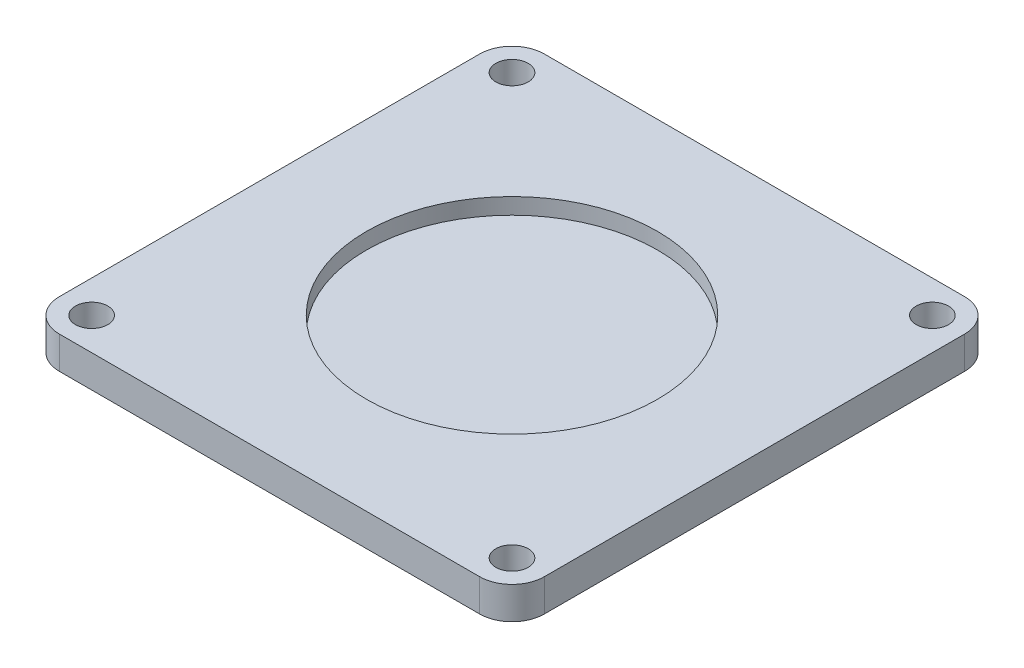
ISO-10303-21;
HEADER;
FILE_DESCRIPTION(('STEP AP214'),'2;1');
FILE_NAME('part.step','',(''),(''),'','','');
FILE_SCHEMA(('AUTOMOTIVE_DESIGN { 1 0 10303 214 1 1 1 1 }'));
ENDSEC;
DATA;
#1=APPLICATION_CONTEXT('core data for automotive mechanical design processes');
#2=APPLICATION_PROTOCOL_DEFINITION('international standard','automotive_design',2000,#1);
#3=PRODUCT_CONTEXT('',#1,'mechanical');
#4=PRODUCT('Part','Part','',(#3));
#5=PRODUCT_RELATED_PRODUCT_CATEGORY('part','',(#4));
#6=PRODUCT_DEFINITION_FORMATION('','',#4);
#7=PRODUCT_DEFINITION_CONTEXT('part definition',#1,'design');
#8=PRODUCT_DEFINITION('design','',#6,#7);
#9=PRODUCT_DEFINITION_SHAPE('','',#8);
#10=(LENGTH_UNIT() NAMED_UNIT(*) SI_UNIT(.MILLI.,.METRE.));
#11=(NAMED_UNIT(*) PLANE_ANGLE_UNIT() SI_UNIT($,.RADIAN.));
#12=(NAMED_UNIT(*) SI_UNIT($,.STERADIAN.) SOLID_ANGLE_UNIT());
#13=UNCERTAINTY_MEASURE_WITH_UNIT(LENGTH_MEASURE(1.E-05),#10,'distance_accuracy_value','');
#14=(GEOMETRIC_REPRESENTATION_CONTEXT(3) GLOBAL_UNCERTAINTY_ASSIGNED_CONTEXT((#13)) GLOBAL_UNIT_ASSIGNED_CONTEXT((#10,
#11,#12)) REPRESENTATION_CONTEXT('',''));
#15=CARTESIAN_POINT('',(0.,0.,0.));
#16=DIRECTION('',(0.,0.,1.));
#17=DIRECTION('',(1.,0.,0.));
#18=AXIS2_PLACEMENT_3D('',#15,#16,#17);
#19=CARTESIAN_POINT('',(15.,2.,-15.));
#20=DIRECTION('',(-1.,0.,0.));
#21=DIRECTION('',(0.,0.,1.));
#22=AXIS2_PLACEMENT_3D('',#19,#20,#21);
#23=PLANE('',#22);
#24=DIRECTION('',(0.,0.,-1.));
#25=VECTOR('',#24,1.);
#26=CARTESIAN_POINT('',(15.,2.,-15.));
#27=LINE('',#26,#25);
#28=CARTESIAN_POINT('',(15.,2.,13.));
#29=VERTEX_POINT('',#28);
#30=CARTESIAN_POINT('',(15.,2.,-13.));
#31=VERTEX_POINT('',#30);
#32=EDGE_CURVE('E140',#29,#31,#27,.T.);
#33=ORIENTED_EDGE('',*,*,#32,.F.);
#34=DIRECTION('',(0.,-1.,0.));
#35=VECTOR('',#34,1.);
#36=CARTESIAN_POINT('',(15.,2.,13.));
#37=LINE('',#36,#35);
#38=CARTESIAN_POINT('',(15.,0.,13.));
#39=VERTEX_POINT('',#38);
#40=EDGE_CURVE('E11',#29,#39,#37,.T.);
#41=ORIENTED_EDGE('',*,*,#40,.T.);
#42=DIRECTION('',(0.,0.,-1.));
#43=VECTOR('',#42,1.);
#44=CARTESIAN_POINT('',(15.,0.,-15.));
#45=LINE('',#44,#43);
#46=CARTESIAN_POINT('',(15.,0.,-13.));
#47=VERTEX_POINT('',#46);
#48=EDGE_CURVE('E142',#39,#47,#45,.T.);
#49=ORIENTED_EDGE('',*,*,#48,.T.);
#50=DIRECTION('',(0.,-1.,0.));
#51=VECTOR('',#50,1.);
#52=CARTESIAN_POINT('',(15.,2.,-13.));
#53=LINE('',#52,#51);
#54=EDGE_CURVE('E48',#47,#31,#53,.F.);
#55=ORIENTED_EDGE('',*,*,#54,.T.);
#56=EDGE_LOOP('',(#33,#41,#49,#55));
#57=FACE_BOUND('',#56,.T.);
#58=ADVANCED_FACE('F39',(#57),#23,.F.);
#59=CARTESIAN_POINT('',(-15.,2.,-15.));
#60=DIRECTION('',(0.,0.,1.));
#61=DIRECTION('',(1.,0.,0.));
#62=AXIS2_PLACEMENT_3D('',#59,#60,#61);
#63=PLANE('',#62);
#64=DIRECTION('',(-1.,0.,0.));
#65=VECTOR('',#64,1.);
#66=CARTESIAN_POINT('',(-15.,0.,-15.));
#67=LINE('',#66,#65);
#68=CARTESIAN_POINT('',(13.,0.,-15.));
#69=VERTEX_POINT('',#68);
#70=CARTESIAN_POINT('',(-13.,0.,-15.));
#71=VERTEX_POINT('',#70);
#72=EDGE_CURVE('E136',#69,#71,#67,.T.);
#73=ORIENTED_EDGE('',*,*,#72,.T.);
#74=DIRECTION('',(0.,-1.,0.));
#75=VECTOR('',#74,1.);
#76=CARTESIAN_POINT('',(-13.,2.,-15.));
#77=LINE('',#76,#75);
#78=CARTESIAN_POINT('',(-13.,2.,-15.));
#79=VERTEX_POINT('',#78);
#80=EDGE_CURVE('E112',#71,#79,#77,.F.);
#81=ORIENTED_EDGE('',*,*,#80,.T.);
#82=DIRECTION('',(-1.,0.,0.));
#83=VECTOR('',#82,1.);
#84=CARTESIAN_POINT('',(-15.,2.,-15.));
#85=LINE('',#84,#83);
#86=CARTESIAN_POINT('',(13.,2.,-15.));
#87=VERTEX_POINT('',#86);
#88=EDGE_CURVE('E208',#87,#79,#85,.T.);
#89=ORIENTED_EDGE('',*,*,#88,.F.);
#90=DIRECTION('',(0.,-1.,0.));
#91=VECTOR('',#90,1.);
#92=CARTESIAN_POINT('',(13.,2.,-15.));
#93=LINE('',#92,#91);
#94=EDGE_CURVE('E118',#87,#69,#93,.T.);
#95=ORIENTED_EDGE('',*,*,#94,.T.);
#96=EDGE_LOOP('',(#73,#81,#89,#95));
#97=FACE_BOUND('',#96,.T.);
#98=ADVANCED_FACE('F212',(#97),#63,.F.);
#99=CARTESIAN_POINT('',(-15.,2.,-15.));
#100=DIRECTION('',(1.,0.,0.));
#101=DIRECTION('',(0.,0.,-1.));
#102=AXIS2_PLACEMENT_3D('',#99,#100,#101);
#103=PLANE('',#102);
#104=DIRECTION('',(0.,0.,1.));
#105=VECTOR('',#104,1.);
#106=CARTESIAN_POINT('',(-15.,2.,-15.));
#107=LINE('',#106,#105);
#108=CARTESIAN_POINT('',(-15.,2.,-13.));
#109=VERTEX_POINT('',#108);
#110=CARTESIAN_POINT('',(-15.,2.,13.));
#111=VERTEX_POINT('',#110);
#112=EDGE_CURVE('E127',#109,#111,#107,.T.);
#113=ORIENTED_EDGE('',*,*,#112,.F.);
#114=DIRECTION('',(0.,-1.,0.));
#115=VECTOR('',#114,1.);
#116=CARTESIAN_POINT('',(-15.,2.,-13.));
#117=LINE('',#116,#115);
#118=CARTESIAN_POINT('',(-15.,0.,-13.));
#119=VERTEX_POINT('',#118);
#120=EDGE_CURVE('E111',#109,#119,#117,.T.);
#121=ORIENTED_EDGE('',*,*,#120,.T.);
#122=DIRECTION('',(0.,0.,1.));
#123=VECTOR('',#122,1.);
#124=CARTESIAN_POINT('',(-15.,0.,-15.));
#125=LINE('',#124,#123);
#126=CARTESIAN_POINT('',(-15.,0.,13.));
#127=VERTEX_POINT('',#126);
#128=EDGE_CURVE('E125',#119,#127,#125,.T.);
#129=ORIENTED_EDGE('',*,*,#128,.T.);
#130=DIRECTION('',(0.,-1.,0.));
#131=VECTOR('',#130,1.);
#132=CARTESIAN_POINT('',(-15.,2.,13.));
#133=LINE('',#132,#131);
#134=EDGE_CURVE('E130',#127,#111,#133,.F.);
#135=ORIENTED_EDGE('',*,*,#134,.T.);
#136=EDGE_LOOP('',(#113,#121,#129,#135));
#137=FACE_BOUND('',#136,.T.);
#138=ADVANCED_FACE('F124',(#137),#103,.F.);
#139=CARTESIAN_POINT('',(-15.,2.,15.));
#140=DIRECTION('',(0.,0.,-1.));
#141=DIRECTION('',(-1.,0.,0.));
#142=AXIS2_PLACEMENT_3D('',#139,#140,#141);
#143=PLANE('',#142);
#144=DIRECTION('',(1.,0.,0.));
#145=VECTOR('',#144,1.);
#146=CARTESIAN_POINT('',(-15.,2.,15.));
#147=LINE('',#146,#145);
#148=CARTESIAN_POINT('',(-13.,2.,15.));
#149=VERTEX_POINT('',#148);
#150=CARTESIAN_POINT('',(13.,2.,15.));
#151=VERTEX_POINT('',#150);
#152=EDGE_CURVE('E220',#149,#151,#147,.T.);
#153=ORIENTED_EDGE('',*,*,#152,.F.);
#154=DIRECTION('',(0.,-1.,0.));
#155=VECTOR('',#154,1.);
#156=CARTESIAN_POINT('',(-13.,2.,15.));
#157=LINE('',#156,#155);
#158=CARTESIAN_POINT('',(-13.,0.,15.));
#159=VERTEX_POINT('',#158);
#160=EDGE_CURVE('E190',#149,#159,#157,.T.);
#161=ORIENTED_EDGE('',*,*,#160,.T.);
#162=DIRECTION('',(1.,0.,0.));
#163=VECTOR('',#162,1.);
#164=CARTESIAN_POINT('',(-15.,0.,15.));
#165=LINE('',#164,#163);
#166=CARTESIAN_POINT('',(13.,0.,15.));
#167=VERTEX_POINT('',#166);
#168=EDGE_CURVE('E135',#159,#167,#165,.T.);
#169=ORIENTED_EDGE('',*,*,#168,.T.);
#170=DIRECTION('',(0.,-1.,0.));
#171=VECTOR('',#170,1.);
#172=CARTESIAN_POINT('',(13.,2.,15.));
#173=LINE('',#172,#171);
#174=EDGE_CURVE('E55',#167,#151,#173,.F.);
#175=ORIENTED_EDGE('',*,*,#174,.T.);
#176=EDGE_LOOP('',(#153,#161,#169,#175));
#177=FACE_BOUND('',#176,.T.);
#178=ADVANCED_FACE('F363',(#177),#143,.F.);
#179=CARTESIAN_POINT('',(0.,2.,0.));
#180=DIRECTION('',(0.,1.,0.));
#181=DIRECTION('',(0.,0.,1.));
#182=AXIS2_PLACEMENT_3D('',#179,#180,#181);
#183=PLANE('',#182);
#184=CARTESIAN_POINT('',(13.,2.,13.));
#185=DIRECTION('',(0.,-1.,0.));
#186=DIRECTION('',(0.,0.,-1.));
#187=AXIS2_PLACEMENT_3D('',#184,#185,#186);
#188=CIRCLE('',#187,1.);
#189=CARTESIAN_POINT('',(13.,2.,12.));
#190=VERTEX_POINT('',#189);
#191=EDGE_CURVE('E246',#190,#190,#188,.T.);
#192=ORIENTED_EDGE('',*,*,#191,.T.);
#193=EDGE_LOOP('',(#192));
#194=FACE_BOUND('',#193,.T.);
#195=CARTESIAN_POINT('',(13.,2.,-13.));
#196=DIRECTION('',(0.,-1.,0.));
#197=DIRECTION('',(0.,0.,-1.));
#198=AXIS2_PLACEMENT_3D('',#195,#196,#197);
#199=CIRCLE('',#198,1.);
#200=CARTESIAN_POINT('',(13.,2.,-14.));
#201=VERTEX_POINT('',#200);
#202=EDGE_CURVE('E254',#201,#201,#199,.T.);
#203=ORIENTED_EDGE('',*,*,#202,.T.);
#204=EDGE_LOOP('',(#203));
#205=FACE_BOUND('',#204,.T.);
#206=CARTESIAN_POINT('',(-13.,2.,-13.));
#207=DIRECTION('',(0.,-1.,0.));
#208=DIRECTION('',(0.,0.,-1.));
#209=AXIS2_PLACEMENT_3D('',#206,#207,#208);
#210=CIRCLE('',#209,1.);
#211=CARTESIAN_POINT('',(-13.,2.,-14.));
#212=VERTEX_POINT('',#211);
#213=EDGE_CURVE('E262',#212,#212,#210,.T.);
#214=ORIENTED_EDGE('',*,*,#213,.T.);
#215=EDGE_LOOP('',(#214));
#216=FACE_BOUND('',#215,.T.);
#217=CARTESIAN_POINT('',(-13.,2.,13.));
#218=DIRECTION('',(0.,-1.,0.));
#219=DIRECTION('',(0.,0.,-1.));
#220=AXIS2_PLACEMENT_3D('',#217,#218,#219);
#221=CIRCLE('',#220,1.);
#222=CARTESIAN_POINT('',(-13.,2.,12.));
#223=VERTEX_POINT('',#222);
#224=EDGE_CURVE('E237',#223,#223,#221,.T.);
#225=ORIENTED_EDGE('',*,*,#224,.T.);
#226=EDGE_LOOP('',(#225));
#227=FACE_BOUND('',#226,.T.);
#228=CARTESIAN_POINT('',(0.,2.,0.));
#229=DIRECTION('',(0.,1.,0.));
#230=DIRECTION('',(0.,0.,1.));
#231=AXIS2_PLACEMENT_3D('',#228,#229,#230);
#232=CIRCLE('',#231,9.);
#233=CARTESIAN_POINT('',(0.,2.,9.));
#234=VERTEX_POINT('',#233);
#235=EDGE_CURVE('E217',#234,#234,#232,.T.);
#236=ORIENTED_EDGE('',*,*,#235,.F.);
#237=EDGE_LOOP('',(#236));
#238=FACE_BOUND('',#237,.T.);
#239=ORIENTED_EDGE('',*,*,#88,.T.);
#240=CARTESIAN_POINT('',(-13.,2.,-13.));
#241=DIRECTION('',(0.,1.,0.));
#242=DIRECTION('',(0.,0.,1.));
#243=AXIS2_PLACEMENT_3D('',#240,#241,#242);
#244=CIRCLE('',#243,2.);
#245=EDGE_CURVE('E185',#79,#109,#244,.T.);
#246=ORIENTED_EDGE('',*,*,#245,.T.);
#247=ORIENTED_EDGE('',*,*,#112,.T.);
#248=CARTESIAN_POINT('',(-13.,2.,13.));
#249=DIRECTION('',(0.,1.,0.));
#250=DIRECTION('',(0.,0.,1.));
#251=AXIS2_PLACEMENT_3D('',#248,#249,#250);
#252=CIRCLE('',#251,2.);
#253=EDGE_CURVE('E62',#111,#149,#252,.T.);
#254=ORIENTED_EDGE('',*,*,#253,.T.);
#255=ORIENTED_EDGE('',*,*,#152,.T.);
#256=CARTESIAN_POINT('',(13.,2.,13.));
#257=DIRECTION('',(0.,1.,0.));
#258=DIRECTION('',(0.,0.,1.));
#259=AXIS2_PLACEMENT_3D('',#256,#257,#258);
#260=CIRCLE('',#259,2.);
#261=EDGE_CURVE('E180',#151,#29,#260,.T.);
#262=ORIENTED_EDGE('',*,*,#261,.T.);
#263=ORIENTED_EDGE('',*,*,#32,.T.);
#264=CARTESIAN_POINT('',(13.,2.,-13.));
#265=DIRECTION('',(0.,1.,0.));
#266=DIRECTION('',(0.,0.,1.));
#267=AXIS2_PLACEMENT_3D('',#264,#265,#266);
#268=CIRCLE('',#267,2.);
#269=EDGE_CURVE('E177',#31,#87,#268,.T.);
#270=ORIENTED_EDGE('',*,*,#269,.T.);
#271=EDGE_LOOP('',(#239,#246,#247,#254,#255,#262,#263,#270));
#272=FACE_BOUND('',#271,.T.);
#273=ADVANCED_FACE('F204',(#194,#205,#216,#227,#238,#272),#183,.T.);
#274=CARTESIAN_POINT('',(0.,0.,0.));
#275=DIRECTION('',(0.,1.,0.));
#276=DIRECTION('',(0.,0.,1.));
#277=AXIS2_PLACEMENT_3D('',#274,#275,#276);
#278=PLANE('',#277);
#279=CARTESIAN_POINT('',(13.,0.,13.));
#280=DIRECTION('',(0.,-1.,0.));
#281=DIRECTION('',(0.,0.,-1.));
#282=AXIS2_PLACEMENT_3D('',#279,#280,#281);
#283=CIRCLE('',#282,1.);
#284=CARTESIAN_POINT('',(13.,0.,12.));
#285=VERTEX_POINT('',#284);
#286=EDGE_CURVE('E250',#285,#285,#283,.T.);
#287=ORIENTED_EDGE('',*,*,#286,.F.);
#288=EDGE_LOOP('',(#287));
#289=FACE_BOUND('',#288,.T.);
#290=CARTESIAN_POINT('',(13.,0.,-13.));
#291=DIRECTION('',(0.,-1.,0.));
#292=DIRECTION('',(0.,0.,-1.));
#293=AXIS2_PLACEMENT_3D('',#290,#291,#292);
#294=CIRCLE('',#293,1.);
#295=CARTESIAN_POINT('',(13.,0.,-14.));
#296=VERTEX_POINT('',#295);
#297=EDGE_CURVE('E258',#296,#296,#294,.T.);
#298=ORIENTED_EDGE('',*,*,#297,.F.);
#299=EDGE_LOOP('',(#298));
#300=FACE_BOUND('',#299,.T.);
#301=CARTESIAN_POINT('',(-13.,0.,-13.));
#302=DIRECTION('',(0.,-1.,0.));
#303=DIRECTION('',(0.,0.,-1.));
#304=AXIS2_PLACEMENT_3D('',#301,#302,#303);
#305=CIRCLE('',#304,1.);
#306=CARTESIAN_POINT('',(-13.,0.,-14.));
#307=VERTEX_POINT('',#306);
#308=EDGE_CURVE('E242',#307,#307,#305,.T.);
#309=ORIENTED_EDGE('',*,*,#308,.F.);
#310=EDGE_LOOP('',(#309));
#311=FACE_BOUND('',#310,.T.);
#312=CARTESIAN_POINT('',(-13.,0.,13.));
#313=DIRECTION('',(0.,-1.,0.));
#314=DIRECTION('',(0.,0.,-1.));
#315=AXIS2_PLACEMENT_3D('',#312,#313,#314);
#316=CIRCLE('',#315,1.);
#317=CARTESIAN_POINT('',(-13.,0.,12.));
#318=VERTEX_POINT('',#317);
#319=EDGE_CURVE('E238',#318,#318,#316,.T.);
#320=ORIENTED_EDGE('',*,*,#319,.F.);
#321=EDGE_LOOP('',(#320));
#322=FACE_BOUND('',#321,.T.);
#323=CARTESIAN_POINT('',(0.,0.,0.));
#324=DIRECTION('',(0.,-1.,0.));
#325=DIRECTION('',(0.,0.,-1.));
#326=AXIS2_PLACEMENT_3D('',#323,#324,#325);
#327=CIRCLE('',#326,10.);
#328=CARTESIAN_POINT('',(0.,0.,-10.));
#329=VERTEX_POINT('',#328);
#330=EDGE_CURVE('E151',#329,#329,#327,.T.);
#331=ORIENTED_EDGE('',*,*,#330,.F.);
#332=EDGE_LOOP('',(#331));
#333=FACE_BOUND('',#332,.T.);
#334=ORIENTED_EDGE('',*,*,#128,.F.);
#335=CARTESIAN_POINT('',(-13.,0.,-13.));
#336=DIRECTION('',(0.,1.,0.));
#337=DIRECTION('',(0.,0.,1.));
#338=AXIS2_PLACEMENT_3D('',#335,#336,#337);
#339=CIRCLE('',#338,2.);
#340=EDGE_CURVE('E107',#119,#71,#339,.F.);
#341=ORIENTED_EDGE('',*,*,#340,.T.);
#342=ORIENTED_EDGE('',*,*,#72,.F.);
#343=CARTESIAN_POINT('',(13.,0.,-13.));
#344=DIRECTION('',(0.,1.,0.));
#345=DIRECTION('',(0.,0.,1.));
#346=AXIS2_PLACEMENT_3D('',#343,#344,#345);
#347=CIRCLE('',#346,2.);
#348=EDGE_CURVE('E129',#69,#47,#347,.F.);
#349=ORIENTED_EDGE('',*,*,#348,.T.);
#350=ORIENTED_EDGE('',*,*,#48,.F.);
#351=CARTESIAN_POINT('',(13.,0.,13.));
#352=DIRECTION('',(0.,1.,0.));
#353=DIRECTION('',(0.,0.,1.));
#354=AXIS2_PLACEMENT_3D('',#351,#352,#353);
#355=CIRCLE('',#354,2.);
#356=EDGE_CURVE('E167',#39,#167,#355,.F.);
#357=ORIENTED_EDGE('',*,*,#356,.T.);
#358=ORIENTED_EDGE('',*,*,#168,.F.);
#359=CARTESIAN_POINT('',(-13.,0.,13.));
#360=DIRECTION('',(0.,1.,0.));
#361=DIRECTION('',(0.,0.,1.));
#362=AXIS2_PLACEMENT_3D('',#359,#360,#361);
#363=CIRCLE('',#362,2.);
#364=EDGE_CURVE('E119',#159,#127,#363,.F.);
#365=ORIENTED_EDGE('',*,*,#364,.T.);
#366=EDGE_LOOP('',(#334,#341,#342,#349,#350,#357,#358,#365));
#367=FACE_BOUND('',#366,.T.);
#368=ADVANCED_FACE('F132',(#289,#300,#311,#322,#333,#367),#278,.F.);
#369=CARTESIAN_POINT('',(0.,1.,0.));
#370=DIRECTION('',(0.,1.,0.));
#371=DIRECTION('',(0.,0.,1.));
#372=AXIS2_PLACEMENT_3D('',#369,#370,#371);
#373=CYLINDRICAL_SURFACE('',#372,9.);
#374=CARTESIAN_POINT('',(0.,1.,0.));
#375=DIRECTION('',(0.,1.,0.));
#376=DIRECTION('',(0.,0.,1.));
#377=AXIS2_PLACEMENT_3D('',#374,#375,#376);
#378=CIRCLE('',#377,9.);
#379=CARTESIAN_POINT('',(0.,1.,9.));
#380=VERTEX_POINT('',#379);
#381=EDGE_CURVE('E214',#380,#380,#378,.T.);
#382=ORIENTED_EDGE('',*,*,#381,.F.);
#383=EDGE_LOOP('',(#382));
#384=FACE_BOUND('',#383,.T.);
#385=ORIENTED_EDGE('',*,*,#235,.T.);
#386=EDGE_LOOP('',(#385));
#387=FACE_BOUND('',#386,.T.);
#388=ADVANCED_FACE('F274',(#384,#387),#373,.F.);
#389=CARTESIAN_POINT('',(0.,1.,0.));
#390=DIRECTION('',(0.,1.,0.));
#391=DIRECTION('',(0.,0.,1.));
#392=AXIS2_PLACEMENT_3D('',#389,#390,#391);
#393=PLANE('',#392);
#394=ORIENTED_EDGE('',*,*,#381,.T.);
#395=EDGE_LOOP('',(#394));
#396=FACE_BOUND('',#395,.T.);
#397=ADVANCED_FACE('F284',(#396),#393,.T.);
#398=CARTESIAN_POINT('',(0.,-3.,0.));
#399=DIRECTION('',(0.,1.,0.));
#400=DIRECTION('',(0.,0.,1.));
#401=AXIS2_PLACEMENT_3D('',#398,#399,#400);
#402=CYLINDRICAL_SURFACE('',#401,10.);
#403=CARTESIAN_POINT('',(0.,-2.,0.));
#404=DIRECTION('',(0.,-1.,0.));
#405=DIRECTION('',(0.,0.,-1.));
#406=AXIS2_PLACEMENT_3D('',#403,#404,#405);
#407=CIRCLE('',#406,10.);
#408=CARTESIAN_POINT('',(0.,-2.,-10.));
#409=VERTEX_POINT('',#408);
#410=EDGE_CURVE('E150',#409,#409,#407,.F.);
#411=ORIENTED_EDGE('',*,*,#410,.T.);
#412=EDGE_LOOP('',(#411));
#413=FACE_BOUND('',#412,.T.);
#414=ORIENTED_EDGE('',*,*,#330,.T.);
#415=EDGE_LOOP('',(#414));
#416=FACE_BOUND('',#415,.T.);
#417=ADVANCED_FACE('F281',(#413,#416),#402,.T.);
#418=CARTESIAN_POINT('',(0.,-3.,0.));
#419=DIRECTION('',(0.,-1.,0.));
#420=DIRECTION('',(0.,0.,-1.));
#421=AXIS2_PLACEMENT_3D('',#418,#419,#420);
#422=PLANE('',#421);
#423=CARTESIAN_POINT('',(0.,-3.,0.));
#424=DIRECTION('',(0.,-1.,0.));
#425=DIRECTION('',(0.,0.,-1.));
#426=AXIS2_PLACEMENT_3D('',#423,#424,#425);
#427=CIRCLE('',#426,9.);
#428=CARTESIAN_POINT('',(0.,-3.,-9.));
#429=VERTEX_POINT('',#428);
#430=EDGE_CURVE('E146',#429,#429,#427,.T.);
#431=ORIENTED_EDGE('',*,*,#430,.T.);
#432=EDGE_LOOP('',(#431));
#433=FACE_BOUND('',#432,.T.);
#434=CARTESIAN_POINT('',(0.,-3.,0.));
#435=DIRECTION('',(0.,-1.,0.));
#436=DIRECTION('',(0.,0.,-1.));
#437=AXIS2_PLACEMENT_3D('',#434,#435,#436);
#438=CIRCLE('',#437,1.);
#439=CARTESIAN_POINT('',(0.,-3.,-1.));
#440=VERTEX_POINT('',#439);
#441=EDGE_CURVE('E229',#440,#440,#438,.T.);
#442=ORIENTED_EDGE('',*,*,#441,.F.);
#443=EDGE_LOOP('',(#442));
#444=FACE_BOUND('',#443,.T.);
#445=ADVANCED_FACE('F283',(#433,#444),#422,.T.);
#446=CARTESIAN_POINT('',(0.,-6.,0.));
#447=DIRECTION('',(0.,1.,0.));
#448=DIRECTION('',(0.,0.,1.));
#449=AXIS2_PLACEMENT_3D('',#446,#447,#448);
#450=CYLINDRICAL_SURFACE('',#449,1.);
#451=CARTESIAN_POINT('',(0.,-5.50000000000006,0.));
#452=DIRECTION('',(0.,-1.,0.));
#453=DIRECTION('',(0.,0.,-1.));
#454=AXIS2_PLACEMENT_3D('',#451,#452,#453);
#455=CIRCLE('',#454,1.);
#456=CARTESIAN_POINT('',(0.,-5.50000000000006,-1.));
#457=VERTEX_POINT('',#456);
#458=EDGE_CURVE('E159',#457,#457,#455,.F.);
#459=ORIENTED_EDGE('',*,*,#458,.T.);
#460=EDGE_LOOP('',(#459));
#461=FACE_BOUND('',#460,.T.);
#462=ORIENTED_EDGE('',*,*,#441,.T.);
#463=EDGE_LOOP('',(#462));
#464=FACE_BOUND('',#463,.T.);
#465=ADVANCED_FACE('F291',(#461,#464),#450,.T.);
#466=CARTESIAN_POINT('',(0.,-6.,0.));
#467=DIRECTION('',(0.,-1.,0.));
#468=DIRECTION('',(0.,0.,-1.));
#469=AXIS2_PLACEMENT_3D('',#466,#467,#468);
#470=PLANE('',#469);
#471=CARTESIAN_POINT('',(0.,-6.,0.));
#472=DIRECTION('',(0.,-1.,0.));
#473=DIRECTION('',(0.,0.,-1.));
#474=AXIS2_PLACEMENT_3D('',#471,#472,#473);
#475=CIRCLE('',#474,0.911836509645781);
#476=CARTESIAN_POINT('',(0.,-6.,-0.911836509645781));
#477=VERTEX_POINT('',#476);
#478=EDGE_CURVE('E155',#477,#477,#475,.T.);
#479=ORIENTED_EDGE('',*,*,#478,.T.);
#480=EDGE_LOOP('',(#479));
#481=FACE_BOUND('',#480,.T.);
#482=ADVANCED_FACE('F308',(#481),#470,.T.);
#483=CARTESIAN_POINT('',(0.,-2.,0.));
#484=DIRECTION('',(0.,-1.,0.));
#485=DIRECTION('',(0.,0.,-1.));
#486=AXIS2_PLACEMENT_3D('',#483,#484,#485);
#487=TOROIDAL_SURFACE('',#486,9.,1.);
#488=ORIENTED_EDGE('',*,*,#410,.F.);
#489=EDGE_LOOP('',(#488));
#490=FACE_BOUND('',#489,.T.);
#491=ORIENTED_EDGE('',*,*,#430,.F.);
#492=EDGE_LOOP('',(#491));
#493=FACE_BOUND('',#492,.T.);
#494=ADVANCED_FACE('F304',(#490,#493),#487,.T.);
#495=CARTESIAN_POINT('',(0.,-6.,0.));
#496=DIRECTION('',(0.,1.,0.));
#497=DIRECTION('',(0.,0.,1.));
#498=AXIS2_PLACEMENT_3D('',#495,#496,#497);
#499=CONICAL_SURFACE('',#498,0.911836509645781,0.174532925199429);
#500=ORIENTED_EDGE('',*,*,#458,.F.);
#501=EDGE_LOOP('',(#500));
#502=FACE_BOUND('',#501,.T.);
#503=ORIENTED_EDGE('',*,*,#478,.F.);
#504=EDGE_LOOP('',(#503));
#505=FACE_BOUND('',#504,.T.);
#506=ADVANCED_FACE('F307',(#502,#505),#499,.T.);
#507=CARTESIAN_POINT('',(-13.,2.,13.));
#508=DIRECTION('',(0.,-1.,0.));
#509=DIRECTION('',(0.,0.,-1.));
#510=AXIS2_PLACEMENT_3D('',#507,#508,#509);
#511=CYLINDRICAL_SURFACE('',#510,1.);
#512=ORIENTED_EDGE('',*,*,#224,.F.);
#513=EDGE_LOOP('',(#512));
#514=FACE_BOUND('',#513,.T.);
#515=ORIENTED_EDGE('',*,*,#319,.T.);
#516=EDGE_LOOP('',(#515));
#517=FACE_BOUND('',#516,.T.);
#518=ADVANCED_FACE('F312',(#514,#517),#511,.F.);
#519=CARTESIAN_POINT('',(-13.,2.,-13.));
#520=DIRECTION('',(0.,-1.,0.));
#521=DIRECTION('',(0.,0.,-1.));
#522=AXIS2_PLACEMENT_3D('',#519,#520,#521);
#523=CYLINDRICAL_SURFACE('',#522,1.);
#524=ORIENTED_EDGE('',*,*,#213,.F.);
#525=EDGE_LOOP('',(#524));
#526=FACE_BOUND('',#525,.T.);
#527=ORIENTED_EDGE('',*,*,#308,.T.);
#528=EDGE_LOOP('',(#527));
#529=FACE_BOUND('',#528,.T.);
#530=ADVANCED_FACE('F270',(#526,#529),#523,.F.);
#531=CARTESIAN_POINT('',(13.,2.,-13.));
#532=DIRECTION('',(0.,-1.,0.));
#533=DIRECTION('',(0.,0.,-1.));
#534=AXIS2_PLACEMENT_3D('',#531,#532,#533);
#535=CYLINDRICAL_SURFACE('',#534,1.);
#536=ORIENTED_EDGE('',*,*,#202,.F.);
#537=EDGE_LOOP('',(#536));
#538=FACE_BOUND('',#537,.T.);
#539=ORIENTED_EDGE('',*,*,#297,.T.);
#540=EDGE_LOOP('',(#539));
#541=FACE_BOUND('',#540,.T.);
#542=ADVANCED_FACE('F396',(#538,#541),#535,.F.);
#543=CARTESIAN_POINT('',(13.,2.,13.));
#544=DIRECTION('',(0.,-1.,0.));
#545=DIRECTION('',(0.,0.,-1.));
#546=AXIS2_PLACEMENT_3D('',#543,#544,#545);
#547=CYLINDRICAL_SURFACE('',#546,1.);
#548=ORIENTED_EDGE('',*,*,#191,.F.);
#549=EDGE_LOOP('',(#548));
#550=FACE_BOUND('',#549,.T.);
#551=ORIENTED_EDGE('',*,*,#286,.T.);
#552=EDGE_LOOP('',(#551));
#553=FACE_BOUND('',#552,.T.);
#554=ADVANCED_FACE('F317',(#550,#553),#547,.F.);
#555=CARTESIAN_POINT('',(-13.,2.,-13.));
#556=DIRECTION('',(0.,-1.,0.));
#557=DIRECTION('',(0.,0.,-1.));
#558=AXIS2_PLACEMENT_3D('',#555,#556,#557);
#559=CYLINDRICAL_SURFACE('',#558,2.);
#560=ORIENTED_EDGE('',*,*,#245,.F.);
#561=ORIENTED_EDGE('',*,*,#80,.F.);
#562=ORIENTED_EDGE('',*,*,#340,.F.);
#563=ORIENTED_EDGE('',*,*,#120,.F.);
#564=EDGE_LOOP('',(#560,#561,#562,#563));
#565=FACE_BOUND('',#564,.T.);
#566=ADVANCED_FACE('F110',(#565),#559,.T.);
#567=CARTESIAN_POINT('',(-13.,2.,13.));
#568=DIRECTION('',(0.,-1.,0.));
#569=DIRECTION('',(0.,0.,-1.));
#570=AXIS2_PLACEMENT_3D('',#567,#568,#569);
#571=CYLINDRICAL_SURFACE('',#570,2.);
#572=ORIENTED_EDGE('',*,*,#253,.F.);
#573=ORIENTED_EDGE('',*,*,#134,.F.);
#574=ORIENTED_EDGE('',*,*,#364,.F.);
#575=ORIENTED_EDGE('',*,*,#160,.F.);
#576=EDGE_LOOP('',(#572,#573,#574,#575));
#577=FACE_BOUND('',#576,.T.);
#578=ADVANCED_FACE('F316',(#577),#571,.T.);
#579=CARTESIAN_POINT('',(13.,2.,13.));
#580=DIRECTION('',(0.,-1.,0.));
#581=DIRECTION('',(0.,0.,-1.));
#582=AXIS2_PLACEMENT_3D('',#579,#580,#581);
#583=CYLINDRICAL_SURFACE('',#582,2.);
#584=ORIENTED_EDGE('',*,*,#261,.F.);
#585=ORIENTED_EDGE('',*,*,#174,.F.);
#586=ORIENTED_EDGE('',*,*,#356,.F.);
#587=ORIENTED_EDGE('',*,*,#40,.F.);
#588=EDGE_LOOP('',(#584,#585,#586,#587));
#589=FACE_BOUND('',#588,.T.);
#590=ADVANCED_FACE('F319',(#589),#583,.T.);
#591=CARTESIAN_POINT('',(13.,2.,-13.));
#592=DIRECTION('',(0.,-1.,0.));
#593=DIRECTION('',(0.,0.,-1.));
#594=AXIS2_PLACEMENT_3D('',#591,#592,#593);
#595=CYLINDRICAL_SURFACE('',#594,2.);
#596=ORIENTED_EDGE('',*,*,#269,.F.);
#597=ORIENTED_EDGE('',*,*,#54,.F.);
#598=ORIENTED_EDGE('',*,*,#348,.F.);
#599=ORIENTED_EDGE('',*,*,#94,.F.);
#600=EDGE_LOOP('',(#596,#597,#598,#599));
#601=FACE_BOUND('',#600,.T.);
#602=ADVANCED_FACE('F41',(#601),#595,.T.);
#603=CLOSED_SHELL('',(#58,#98,#138,#178,#273,#368,#388,#397,#417,#445,#465,#482,#494,#506,#518,
#530,#542,#554,#566,#578,#590,#602));
#604=MANIFOLD_SOLID_BREP('B2',#603);
#605=ADVANCED_BREP_SHAPE_REPRESENTATION('',(#18,#604),#14);
#606=SHAPE_DEFINITION_REPRESENTATION(#9,#605);
ENDSEC;
END-ISO-10303-21;
